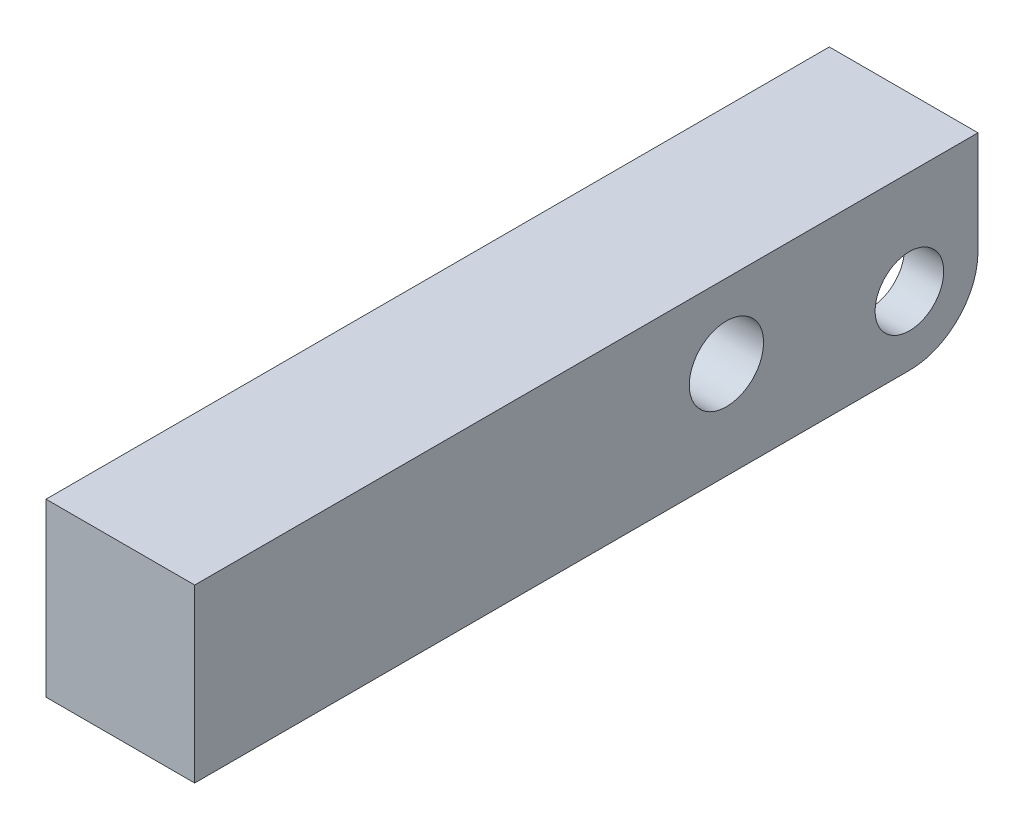
ISO-10303-21;
HEADER;
FILE_DESCRIPTION(('STEP AP214'),'2;1');
FILE_NAME('part.step','',(''),(''),'','','');
FILE_SCHEMA(('AUTOMOTIVE_DESIGN { 1 0 10303 214 1 1 1 1 }'));
ENDSEC;
DATA;
#1=APPLICATION_CONTEXT('core data for automotive mechanical design processes');
#2=APPLICATION_PROTOCOL_DEFINITION('international standard','automotive_design',2000,#1);
#3=PRODUCT_CONTEXT('',#1,'mechanical');
#4=PRODUCT('Part','Part','',(#3));
#5=PRODUCT_RELATED_PRODUCT_CATEGORY('part','',(#4));
#6=PRODUCT_DEFINITION_FORMATION('','',#4);
#7=PRODUCT_DEFINITION_CONTEXT('part definition',#1,'design');
#8=PRODUCT_DEFINITION('design','',#6,#7);
#9=PRODUCT_DEFINITION_SHAPE('','',#8);
#10=(LENGTH_UNIT() NAMED_UNIT(*) SI_UNIT(.MILLI.,.METRE.));
#11=(NAMED_UNIT(*) PLANE_ANGLE_UNIT() SI_UNIT($,.RADIAN.));
#12=(NAMED_UNIT(*) SI_UNIT($,.STERADIAN.) SOLID_ANGLE_UNIT());
#13=UNCERTAINTY_MEASURE_WITH_UNIT(LENGTH_MEASURE(1.E-05),#10,'distance_accuracy_value','');
#14=(GEOMETRIC_REPRESENTATION_CONTEXT(3) GLOBAL_UNCERTAINTY_ASSIGNED_CONTEXT((#13)) GLOBAL_UNIT_ASSIGNED_CONTEXT((#10,
#11,#12)) REPRESENTATION_CONTEXT('',''));
#15=CARTESIAN_POINT('',(0.,0.,0.));
#16=DIRECTION('',(0.,0.,1.));
#17=DIRECTION('',(1.,0.,0.));
#18=AXIS2_PLACEMENT_3D('',#15,#16,#17);
#19=CARTESIAN_POINT('',(-50.,12.,12.));
#20=DIRECTION('',(1.,0.,0.));
#21=DIRECTION('',(0.,0.,-1.));
#22=AXIS2_PLACEMENT_3D('',#19,#20,#21);
#23=CYLINDRICAL_SURFACE('',#22,6.);
#24=CARTESIAN_POINT('',(-6.1468,12.,12.));
#25=DIRECTION('',(-1.,0.,0.));
#26=DIRECTION('',(0.,0.,1.));
#27=AXIS2_PLACEMENT_3D('',#24,#25,#26);
#28=CIRCLE('',#27,6.);
#29=CARTESIAN_POINT('',(-6.1468,12.,18.));
#30=VERTEX_POINT('',#29);
#31=EDGE_CURVE('E198',#30,#30,#28,.F.);
#32=ORIENTED_EDGE('',*,*,#31,.T.);
#33=EDGE_LOOP('',(#32));
#34=FACE_BOUND('',#33,.T.);
#35=CARTESIAN_POINT('',(-13.0048,12.,12.));
#36=DIRECTION('',(-1.,0.,0.));
#37=DIRECTION('',(0.,0.,1.));
#38=AXIS2_PLACEMENT_3D('',#35,#36,#37);
#39=CIRCLE('',#38,6.);
#40=CARTESIAN_POINT('',(-13.0048,12.,18.));
#41=VERTEX_POINT('',#40);
#42=EDGE_CURVE('E161',#41,#41,#39,.T.);
#43=ORIENTED_EDGE('',*,*,#42,.T.);
#44=EDGE_LOOP('',(#43));
#45=FACE_BOUND('',#44,.T.);
#46=ADVANCED_FACE('F32',(#34,#45),#23,.F.);
#47=CARTESIAN_POINT('',(-13.0048,29.9974,0.));
#48=DIRECTION('',(0.,0.,-1.));
#49=DIRECTION('',(0.,1.,0.));
#50=AXIS2_PLACEMENT_3D('',#47,#48,#49);
#51=PLANE('',#50);
#52=DIRECTION('',(0.,1.,0.));
#53=VECTOR('',#52,1.);
#54=CARTESIAN_POINT('',(13.0048,29.9974,0.));
#55=LINE('',#54,#53);
#56=CARTESIAN_POINT('',(13.0048,11.9888,0.));
#57=VERTEX_POINT('',#56);
#58=CARTESIAN_POINT('',(13.0048,29.9974,0.));
#59=VERTEX_POINT('',#58);
#60=EDGE_CURVE('E164',#57,#59,#55,.T.);
#61=ORIENTED_EDGE('',*,*,#60,.F.);
#62=DIRECTION('',(1.,0.,0.));
#63=VECTOR('',#62,1.);
#64=CARTESIAN_POINT('',(-13.0048,11.9888,0.));
#65=LINE('',#64,#63);
#66=CARTESIAN_POINT('',(6.1468,11.9888,0.));
#67=VERTEX_POINT('',#66);
#68=EDGE_CURVE('E211',#57,#67,#65,.F.);
#69=ORIENTED_EDGE('',*,*,#68,.T.);
#70=DIRECTION('',(0.,-1.,0.));
#71=VECTOR('',#70,1.);
#72=CARTESIAN_POINT('',(6.1468,26.4,0.));
#73=LINE('',#72,#71);
#74=CARTESIAN_POINT('',(6.1468,26.4,0.));
#75=VERTEX_POINT('',#74);
#76=EDGE_CURVE('E131',#75,#67,#73,.T.);
#77=ORIENTED_EDGE('',*,*,#76,.F.);
#78=DIRECTION('',(1.,0.,0.));
#79=VECTOR('',#78,1.);
#80=CARTESIAN_POINT('',(-6.1468,26.4,0.));
#81=LINE('',#80,#79);
#82=CARTESIAN_POINT('',(-6.1468,26.4,0.));
#83=VERTEX_POINT('',#82);
#84=EDGE_CURVE('E138',#83,#75,#81,.T.);
#85=ORIENTED_EDGE('',*,*,#84,.F.);
#86=DIRECTION('',(0.,-1.,0.));
#87=VECTOR('',#86,1.);
#88=CARTESIAN_POINT('',(-6.1468,26.4,0.));
#89=LINE('',#88,#87);
#90=CARTESIAN_POINT('',(-6.1468,11.9888,0.));
#91=VERTEX_POINT('',#90);
#92=EDGE_CURVE('E121',#83,#91,#89,.T.);
#93=ORIENTED_EDGE('',*,*,#92,.T.);
#94=DIRECTION('',(1.,0.,0.));
#95=VECTOR('',#94,1.);
#96=CARTESIAN_POINT('',(-13.0048,11.9888,0.));
#97=LINE('',#96,#95);
#98=CARTESIAN_POINT('',(-13.0048,11.9888,0.));
#99=VERTEX_POINT('',#98);
#100=EDGE_CURVE('E209',#91,#99,#97,.F.);
#101=ORIENTED_EDGE('',*,*,#100,.T.);
#102=DIRECTION('',(0.,1.,0.));
#103=VECTOR('',#102,1.);
#104=CARTESIAN_POINT('',(-13.0048,29.9974,0.));
#105=LINE('',#104,#103);
#106=CARTESIAN_POINT('',(-13.0048,29.9974,0.));
#107=VERTEX_POINT('',#106);
#108=EDGE_CURVE('E175',#99,#107,#105,.T.);
#109=ORIENTED_EDGE('',*,*,#108,.T.);
#110=DIRECTION('',(1.,0.,0.));
#111=VECTOR('',#110,1.);
#112=CARTESIAN_POINT('',(-13.0048,29.9974,0.));
#113=LINE('',#112,#111);
#114=EDGE_CURVE('E186',#107,#59,#113,.T.);
#115=ORIENTED_EDGE('',*,*,#114,.T.);
#116=EDGE_LOOP('',(#61,#69,#77,#85,#93,#101,#109,#115));
#117=FACE_BOUND('',#116,.T.);
#118=ADVANCED_FACE('F143',(#117),#51,.T.);
#119=CARTESIAN_POINT('',(-13.0048,0.,0.));
#120=DIRECTION('',(0.,-1.,0.));
#121=DIRECTION('',(0.,0.,-1.));
#122=AXIS2_PLACEMENT_3D('',#119,#120,#121);
#123=PLANE('',#122);
#124=CARTESIAN_POINT('',(0.,0.,26.3906));
#125=DIRECTION('',(0.,-1.,0.));
#126=DIRECTION('',(0.,0.,-1.));
#127=AXIS2_PLACEMENT_3D('',#124,#125,#126);
#128=CIRCLE('',#127,6.90880000000001);
#129=CARTESIAN_POINT('',(-6.90880000000001,0.,26.3906));
#130=VERTEX_POINT('',#129);
#131=CARTESIAN_POINT('',(6.90880000000001,0.,26.3906));
#132=VERTEX_POINT('',#131);
#133=EDGE_CURVE('E224',#130,#132,#128,.F.);
#134=ORIENTED_EDGE('',*,*,#133,.T.);
#135=DIRECTION('',(0.,0.,-1.));
#136=VECTOR('',#135,1.);
#137=CARTESIAN_POINT('',(6.90880000000001,0.,11.9888));
#138=LINE('',#137,#136);
#139=CARTESIAN_POINT('',(6.90880000000001,0.,11.9888));
#140=VERTEX_POINT('',#139);
#141=EDGE_CURVE('E226',#132,#140,#138,.T.);
#142=ORIENTED_EDGE('',*,*,#141,.T.);
#143=DIRECTION('',(1.,0.,0.));
#144=VECTOR('',#143,1.);
#145=CARTESIAN_POINT('',(-13.0048,0.,11.9888));
#146=LINE('',#145,#144);
#147=CARTESIAN_POINT('',(13.0048,0.,11.9888));
#148=VERTEX_POINT('',#147);
#149=EDGE_CURVE('E205',#140,#148,#146,.T.);
#150=ORIENTED_EDGE('',*,*,#149,.T.);
#151=DIRECTION('',(0.,0.,-1.));
#152=VECTOR('',#151,1.);
#153=CARTESIAN_POINT('',(13.0048,0.,0.));
#154=LINE('',#153,#152);
#155=CARTESIAN_POINT('',(13.0048,0.,137.0076));
#156=VERTEX_POINT('',#155);
#157=EDGE_CURVE('E172',#156,#148,#154,.T.);
#158=ORIENTED_EDGE('',*,*,#157,.F.);
#159=DIRECTION('',(1.,0.,0.));
#160=VECTOR('',#159,1.);
#161=CARTESIAN_POINT('',(-13.0048,0.,137.0076));
#162=LINE('',#161,#160);
#163=CARTESIAN_POINT('',(-13.0048,0.,137.0076));
#164=VERTEX_POINT('',#163);
#165=EDGE_CURVE('E187',#164,#156,#162,.T.);
#166=ORIENTED_EDGE('',*,*,#165,.F.);
#167=DIRECTION('',(0.,0.,-1.));
#168=VECTOR('',#167,1.);
#169=CARTESIAN_POINT('',(-13.0048,0.,0.));
#170=LINE('',#169,#168);
#171=CARTESIAN_POINT('',(-13.0048,0.,11.9888));
#172=VERTEX_POINT('',#171);
#173=EDGE_CURVE('E183',#164,#172,#170,.T.);
#174=ORIENTED_EDGE('',*,*,#173,.T.);
#175=DIRECTION('',(1.,0.,0.));
#176=VECTOR('',#175,1.);
#177=CARTESIAN_POINT('',(-13.0048,0.,11.9888));
#178=LINE('',#177,#176);
#179=CARTESIAN_POINT('',(-6.90880000000001,0.,11.9888));
#180=VERTEX_POINT('',#179);
#181=EDGE_CURVE('E189',#172,#180,#178,.T.);
#182=ORIENTED_EDGE('',*,*,#181,.T.);
#183=DIRECTION('',(0.,0.,1.));
#184=VECTOR('',#183,1.);
#185=CARTESIAN_POINT('',(-6.90880000000001,0.,26.3906));
#186=LINE('',#185,#184);
#187=EDGE_CURVE('E222',#180,#130,#186,.T.);
#188=ORIENTED_EDGE('',*,*,#187,.T.);
#189=EDGE_LOOP('',(#134,#142,#150,#158,#166,#174,#182,#188));
#190=FACE_BOUND('',#189,.T.);
#191=ADVANCED_FACE('F249',(#190),#123,.T.);
#192=CARTESIAN_POINT('',(-13.0048,0.,137.0076));
#193=DIRECTION('',(0.,0.,1.));
#194=DIRECTION('',(1.,0.,0.));
#195=AXIS2_PLACEMENT_3D('',#192,#193,#194);
#196=PLANE('',#195);
#197=ORIENTED_EDGE('',*,*,#165,.T.);
#198=DIRECTION('',(0.,-1.,0.));
#199=VECTOR('',#198,1.);
#200=CARTESIAN_POINT('',(13.0048,0.,137.0076));
#201=LINE('',#200,#199);
#202=CARTESIAN_POINT('',(13.0048,29.9974,137.0076));
#203=VERTEX_POINT('',#202);
#204=EDGE_CURVE('E169',#203,#156,#201,.T.);
#205=ORIENTED_EDGE('',*,*,#204,.F.);
#206=DIRECTION('',(1.,0.,0.));
#207=VECTOR('',#206,1.);
#208=CARTESIAN_POINT('',(-13.0048,29.9974,137.0076));
#209=LINE('',#208,#207);
#210=CARTESIAN_POINT('',(-13.0048,29.9974,137.0076));
#211=VERTEX_POINT('',#210);
#212=EDGE_CURVE('E190',#211,#203,#209,.T.);
#213=ORIENTED_EDGE('',*,*,#212,.F.);
#214=DIRECTION('',(0.,-1.,0.));
#215=VECTOR('',#214,1.);
#216=CARTESIAN_POINT('',(-13.0048,0.,137.0076));
#217=LINE('',#216,#215);
#218=EDGE_CURVE('E180',#211,#164,#217,.T.);
#219=ORIENTED_EDGE('',*,*,#218,.T.);
#220=EDGE_LOOP('',(#197,#205,#213,#219));
#221=FACE_BOUND('',#220,.T.);
#222=ADVANCED_FACE('F265',(#221),#196,.T.);
#223=CARTESIAN_POINT('',(-13.0048,29.9974,137.0076));
#224=DIRECTION('',(0.,1.,0.));
#225=DIRECTION('',(0.,0.,1.));
#226=AXIS2_PLACEMENT_3D('',#223,#224,#225);
#227=PLANE('',#226);
#228=ORIENTED_EDGE('',*,*,#212,.T.);
#229=DIRECTION('',(0.,0.,1.));
#230=VECTOR('',#229,1.);
#231=CARTESIAN_POINT('',(13.0048,29.9974,137.0076));
#232=LINE('',#231,#230);
#233=EDGE_CURVE('E166',#59,#203,#232,.T.);
#234=ORIENTED_EDGE('',*,*,#233,.F.);
#235=ORIENTED_EDGE('',*,*,#114,.F.);
#236=DIRECTION('',(0.,0.,1.));
#237=VECTOR('',#236,1.);
#238=CARTESIAN_POINT('',(-13.0048,29.9974,137.0076));
#239=LINE('',#238,#237);
#240=EDGE_CURVE('E177',#107,#211,#239,.T.);
#241=ORIENTED_EDGE('',*,*,#240,.T.);
#242=EDGE_LOOP('',(#228,#234,#235,#241));
#243=FACE_BOUND('',#242,.T.);
#244=ADVANCED_FACE('F260',(#243),#227,.T.);
#245=CARTESIAN_POINT('',(-13.0048,0.,0.));
#246=DIRECTION('',(-1.,0.,0.));
#247=DIRECTION('',(0.,0.,1.));
#248=AXIS2_PLACEMENT_3D('',#245,#246,#247);
#249=PLANE('',#248);
#250=CARTESIAN_POINT('',(-13.0048,17.0038,44.004));
#251=DIRECTION('',(-1.,0.,0.));
#252=DIRECTION('',(0.,0.,1.));
#253=AXIS2_PLACEMENT_3D('',#250,#251,#252);
#254=CIRCLE('',#253,6.5);
#255=CARTESIAN_POINT('',(-13.0048,17.0038,50.504));
#256=VERTEX_POINT('',#255);
#257=EDGE_CURVE('E156',#256,#256,#254,.T.);
#258=ORIENTED_EDGE('',*,*,#257,.F.);
#259=EDGE_LOOP('',(#258));
#260=FACE_BOUND('',#259,.T.);
#261=ORIENTED_EDGE('',*,*,#42,.F.);
#262=EDGE_LOOP('',(#261));
#263=FACE_BOUND('',#262,.T.);
#264=ORIENTED_EDGE('',*,*,#108,.F.);
#265=CARTESIAN_POINT('',(-13.0048,11.9888,11.9888));
#266=DIRECTION('',(-1.,0.,0.));
#267=DIRECTION('',(0.,0.,1.));
#268=AXIS2_PLACEMENT_3D('',#265,#266,#267);
#269=CIRCLE('',#268,11.9888);
#270=EDGE_CURVE('E217',#99,#172,#269,.T.);
#271=ORIENTED_EDGE('',*,*,#270,.T.);
#272=ORIENTED_EDGE('',*,*,#173,.F.);
#273=ORIENTED_EDGE('',*,*,#218,.F.);
#274=ORIENTED_EDGE('',*,*,#240,.F.);
#275=EDGE_LOOP('',(#264,#271,#272,#273,#274));
#276=FACE_BOUND('',#275,.T.);
#277=ADVANCED_FACE('F255',(#260,#263,#276),#249,.T.);
#278=CARTESIAN_POINT('',(13.0048,0.,0.));
#279=DIRECTION('',(-1.,0.,0.));
#280=DIRECTION('',(0.,0.,1.));
#281=AXIS2_PLACEMENT_3D('',#278,#279,#280);
#282=PLANE('',#281);
#283=CARTESIAN_POINT('',(13.0048,17.0038,44.004));
#284=DIRECTION('',(-1.,0.,0.));
#285=DIRECTION('',(0.,0.,1.));
#286=AXIS2_PLACEMENT_3D('',#283,#284,#285);
#287=CIRCLE('',#286,6.5);
#288=CARTESIAN_POINT('',(13.0048,17.0038,50.504));
#289=VERTEX_POINT('',#288);
#290=EDGE_CURVE('E160',#289,#289,#287,.T.);
#291=ORIENTED_EDGE('',*,*,#290,.T.);
#292=EDGE_LOOP('',(#291));
#293=FACE_BOUND('',#292,.T.);
#294=CARTESIAN_POINT('',(13.0048,12.,12.));
#295=DIRECTION('',(-1.,0.,0.));
#296=DIRECTION('',(0.,0.,1.));
#297=AXIS2_PLACEMENT_3D('',#294,#295,#296);
#298=CIRCLE('',#297,6.);
#299=CARTESIAN_POINT('',(13.0048,12.,18.));
#300=VERTEX_POINT('',#299);
#301=EDGE_CURVE('E159',#300,#300,#298,.T.);
#302=ORIENTED_EDGE('',*,*,#301,.T.);
#303=EDGE_LOOP('',(#302));
#304=FACE_BOUND('',#303,.T.);
#305=ORIENTED_EDGE('',*,*,#157,.T.);
#306=CARTESIAN_POINT('',(13.0048,11.9888,11.9888));
#307=DIRECTION('',(-1.,0.,0.));
#308=DIRECTION('',(0.,0.,1.));
#309=AXIS2_PLACEMENT_3D('',#306,#307,#308);
#310=CIRCLE('',#309,11.9888);
#311=EDGE_CURVE('E207',#148,#57,#310,.F.);
#312=ORIENTED_EDGE('',*,*,#311,.T.);
#313=ORIENTED_EDGE('',*,*,#60,.T.);
#314=ORIENTED_EDGE('',*,*,#233,.T.);
#315=ORIENTED_EDGE('',*,*,#204,.T.);
#316=EDGE_LOOP('',(#305,#312,#313,#314,#315));
#317=FACE_BOUND('',#316,.T.);
#318=ADVANCED_FACE('F263',(#293,#304,#317),#282,.F.);
#319=CARTESIAN_POINT('',(6.1468,12.,12.));
#320=DIRECTION('',(1.,0.,0.));
#321=DIRECTION('',(0.,0.,-1.));
#322=AXIS2_PLACEMENT_3D('',#319,#320,#321);
#323=CIRCLE('',#322,6.);
#324=CARTESIAN_POINT('',(6.1468,12.,6.));
#325=VERTEX_POINT('',#324);
#326=EDGE_CURVE('E152',#325,#325,#323,.F.);
#327=ORIENTED_EDGE('',*,*,#326,.T.);
#328=EDGE_LOOP('',(#327));
#329=FACE_BOUND('',#328,.T.);
#330=ORIENTED_EDGE('',*,*,#301,.F.);
#331=EDGE_LOOP('',(#330));
#332=FACE_BOUND('',#331,.T.);
#333=ADVANCED_FACE('F277',(#329,#332),#23,.F.);
#334=CARTESIAN_POINT('',(-50.,17.0038,44.004));
#335=DIRECTION('',(1.,0.,0.));
#336=DIRECTION('',(0.,0.,-1.));
#337=AXIS2_PLACEMENT_3D('',#334,#335,#336);
#338=CYLINDRICAL_SURFACE('',#337,6.5);
#339=ORIENTED_EDGE('',*,*,#257,.T.);
#340=EDGE_LOOP('',(#339));
#341=FACE_BOUND('',#340,.T.);
#342=ORIENTED_EDGE('',*,*,#290,.F.);
#343=EDGE_LOOP('',(#342));
#344=FACE_BOUND('',#343,.T.);
#345=ADVANCED_FACE('F286',(#341,#344),#338,.F.);
#346=CARTESIAN_POINT('',(-6.1468,26.4,26.3906));
#347=DIRECTION('',(-1.,0.,0.));
#348=DIRECTION('',(0.,0.,1.));
#349=AXIS2_PLACEMENT_3D('',#346,#347,#348);
#350=PLANE('',#349);
#351=DIRECTION('',(0.,-1.,0.));
#352=VECTOR('',#351,1.);
#353=CARTESIAN_POINT('',(-6.1468,26.4,26.3906));
#354=LINE('',#353,#352);
#355=CARTESIAN_POINT('',(-6.1468,26.4,26.3906));
#356=VERTEX_POINT('',#355);
#357=CARTESIAN_POINT('',(-6.1468,0.762000000000009,26.3906));
#358=VERTEX_POINT('',#357);
#359=EDGE_CURVE('E150',#356,#358,#354,.T.);
#360=ORIENTED_EDGE('',*,*,#359,.T.);
#361=DIRECTION('',(0.,0.,-1.));
#362=VECTOR('',#361,1.);
#363=CARTESIAN_POINT('',(-6.1468,0.762000000000011,11.9888));
#364=LINE('',#363,#362);
#365=CARTESIAN_POINT('',(-6.1468,0.762000000000013,7.78281768905285));
#366=VERTEX_POINT('',#365);
#367=EDGE_CURVE('E41',#358,#366,#364,.T.);
#368=ORIENTED_EDGE('',*,*,#367,.T.);
#369=CARTESIAN_POINT('',(-6.1468,11.9888,11.9888));
#370=DIRECTION('',(-1.,0.,0.));
#371=DIRECTION('',(0.,0.,1.));
#372=AXIS2_PLACEMENT_3D('',#369,#370,#371);
#373=CIRCLE('',#372,11.9888);
#374=EDGE_CURVE('E127',#366,#91,#373,.F.);
#375=ORIENTED_EDGE('',*,*,#374,.T.);
#376=ORIENTED_EDGE('',*,*,#92,.F.);
#377=DIRECTION('',(0.,0.,-1.));
#378=VECTOR('',#377,1.);
#379=CARTESIAN_POINT('',(-6.1468,26.4,26.3906));
#380=LINE('',#379,#378);
#381=EDGE_CURVE('E125',#356,#83,#380,.T.);
#382=ORIENTED_EDGE('',*,*,#381,.F.);
#383=EDGE_LOOP('',(#360,#368,#375,#376,#382));
#384=FACE_BOUND('',#383,.T.);
#385=ORIENTED_EDGE('',*,*,#31,.F.);
#386=EDGE_LOOP('',(#385));
#387=FACE_BOUND('',#386,.T.);
#388=ADVANCED_FACE('F123',(#384,#387),#350,.F.);
#389=CARTESIAN_POINT('',(6.1468,26.4,26.3906));
#390=DIRECTION('',(1.,0.,0.));
#391=DIRECTION('',(0.,0.,-1.));
#392=AXIS2_PLACEMENT_3D('',#389,#390,#391);
#393=PLANE('',#392);
#394=CARTESIAN_POINT('',(6.1468,11.9888,11.9888));
#395=DIRECTION('',(1.,0.,0.));
#396=DIRECTION('',(0.,0.,-1.));
#397=AXIS2_PLACEMENT_3D('',#394,#395,#396);
#398=CIRCLE('',#397,11.9888);
#399=CARTESIAN_POINT('',(6.1468,0.76200000000001,7.78281768905286));
#400=VERTEX_POINT('',#399);
#401=EDGE_CURVE('E213',#67,#400,#398,.F.);
#402=ORIENTED_EDGE('',*,*,#401,.T.);
#403=DIRECTION('',(0.,0.,1.));
#404=VECTOR('',#403,1.);
#405=CARTESIAN_POINT('',(6.1468,0.762000000000009,26.3906));
#406=LINE('',#405,#404);
#407=CARTESIAN_POINT('',(6.1468,0.762000000000009,26.3906));
#408=VERTEX_POINT('',#407);
#409=EDGE_CURVE('E219',#400,#408,#406,.T.);
#410=ORIENTED_EDGE('',*,*,#409,.T.);
#411=DIRECTION('',(0.,-1.,0.));
#412=VECTOR('',#411,1.);
#413=CARTESIAN_POINT('',(6.1468,26.4,26.3906));
#414=LINE('',#413,#412);
#415=CARTESIAN_POINT('',(6.1468,26.4,26.3906));
#416=VERTEX_POINT('',#415);
#417=EDGE_CURVE('E153',#416,#408,#414,.T.);
#418=ORIENTED_EDGE('',*,*,#417,.F.);
#419=DIRECTION('',(0.,0.,1.));
#420=VECTOR('',#419,1.);
#421=CARTESIAN_POINT('',(6.1468,26.4,26.3906));
#422=LINE('',#421,#420);
#423=EDGE_CURVE('E145',#75,#416,#422,.T.);
#424=ORIENTED_EDGE('',*,*,#423,.F.);
#425=ORIENTED_EDGE('',*,*,#76,.T.);
#426=EDGE_LOOP('',(#402,#410,#418,#424,#425));
#427=FACE_BOUND('',#426,.T.);
#428=ORIENTED_EDGE('',*,*,#326,.F.);
#429=EDGE_LOOP('',(#428));
#430=FACE_BOUND('',#429,.T.);
#431=ADVANCED_FACE('F299',(#427,#430),#393,.F.);
#432=CARTESIAN_POINT('',(0.,26.4,26.3906));
#433=DIRECTION('',(0.,-1.,0.));
#434=DIRECTION('',(0.,0.,-1.));
#435=AXIS2_PLACEMENT_3D('',#432,#433,#434);
#436=CYLINDRICAL_SURFACE('',#435,6.1468);
#437=ORIENTED_EDGE('',*,*,#417,.T.);
#438=CARTESIAN_POINT('',(0.,0.762000000000009,26.3906));
#439=DIRECTION('',(0.,-1.,0.));
#440=DIRECTION('',(0.,0.,-1.));
#441=AXIS2_PLACEMENT_3D('',#438,#439,#440);
#442=CIRCLE('',#441,6.1468);
#443=EDGE_CURVE('E56',#408,#358,#442,.T.);
#444=ORIENTED_EDGE('',*,*,#443,.T.);
#445=ORIENTED_EDGE('',*,*,#359,.F.);
#446=CARTESIAN_POINT('',(0.,26.4,26.3906));
#447=DIRECTION('',(0.,-1.,0.));
#448=DIRECTION('',(0.,0.,-1.));
#449=AXIS2_PLACEMENT_3D('',#446,#447,#448);
#450=CIRCLE('',#449,6.1468);
#451=EDGE_CURVE('E132',#416,#356,#450,.T.);
#452=ORIENTED_EDGE('',*,*,#451,.F.);
#453=EDGE_LOOP('',(#437,#444,#445,#452));
#454=FACE_BOUND('',#453,.T.);
#455=ADVANCED_FACE('F301',(#454),#436,.F.);
#456=CARTESIAN_POINT('',(0.,26.4,26.3906));
#457=DIRECTION('',(0.,-1.,0.));
#458=DIRECTION('',(0.,0.,-1.));
#459=AXIS2_PLACEMENT_3D('',#456,#457,#458);
#460=PLANE('',#459);
#461=ORIENTED_EDGE('',*,*,#381,.T.);
#462=ORIENTED_EDGE('',*,*,#84,.T.);
#463=ORIENTED_EDGE('',*,*,#423,.T.);
#464=ORIENTED_EDGE('',*,*,#451,.T.);
#465=EDGE_LOOP('',(#461,#462,#463,#464));
#466=FACE_BOUND('',#465,.T.);
#467=ADVANCED_FACE('F136',(#466),#460,.T.);
#468=CARTESIAN_POINT('',(-13.0048,11.9888,11.9888));
#469=DIRECTION('',(1.,0.,0.));
#470=DIRECTION('',(0.,0.,-1.));
#471=AXIS2_PLACEMENT_3D('',#468,#469,#470);
#472=CYLINDRICAL_SURFACE('',#471,11.9888);
#473=ORIENTED_EDGE('',*,*,#149,.F.);
#474=CARTESIAN_POINT('',(-5.07999999999995,11.9888,11.9888));
#475=DIRECTION('',(-0.707106781186549,-0.707106781186546,0.));
#476=DIRECTION('',(0.707106781186546,-0.707106781186549,0.));
#477=AXIS2_PLACEMENT_3D('',#474,#475,#476);
#478=ELLIPSE('',#477,16.9547235565785,11.9888);
#479=EDGE_CURVE('E228',#140,#400,#478,.F.);
#480=ORIENTED_EDGE('',*,*,#479,.T.);
#481=ORIENTED_EDGE('',*,*,#401,.F.);
#482=ORIENTED_EDGE('',*,*,#68,.F.);
#483=ORIENTED_EDGE('',*,*,#311,.F.);
#484=EDGE_LOOP('',(#473,#480,#481,#482,#483));
#485=FACE_BOUND('',#484,.T.);
#486=ADVANCED_FACE('F312',(#485),#472,.T.);
#487=CARTESIAN_POINT('',(-13.0048,11.9888,11.9888));
#488=DIRECTION('',(1.,0.,0.));
#489=DIRECTION('',(0.,0.,-1.));
#490=AXIS2_PLACEMENT_3D('',#487,#488,#489);
#491=CYLINDRICAL_SURFACE('',#490,11.9888);
#492=ORIENTED_EDGE('',*,*,#374,.F.);
#493=CARTESIAN_POINT('',(5.07999999999999,11.9888,11.9888));
#494=DIRECTION('',(0.707106781186547,-0.707106781186548,0.));
#495=DIRECTION('',(0.707106781186548,0.707106781186547,0.));
#496=AXIS2_PLACEMENT_3D('',#493,#494,#495);
#497=ELLIPSE('',#496,16.9547235565786,11.9888);
#498=EDGE_CURVE('E11',#366,#180,#497,.F.);
#499=ORIENTED_EDGE('',*,*,#498,.T.);
#500=ORIENTED_EDGE('',*,*,#181,.F.);
#501=ORIENTED_EDGE('',*,*,#270,.F.);
#502=ORIENTED_EDGE('',*,*,#100,.F.);
#503=EDGE_LOOP('',(#492,#499,#500,#501,#502));
#504=FACE_BOUND('',#503,.T.);
#505=ADVANCED_FACE('F246',(#504),#491,.T.);
#506=CARTESIAN_POINT('',(-6.1468,0.762000000000009,26.3906));
#507=DIRECTION('',(0.707106781186547,-0.707106781186548,0.));
#508=DIRECTION('',(0.707106781186548,0.707106781186547,0.));
#509=AXIS2_PLACEMENT_3D('',#506,#507,#508);
#510=PLANE('',#509);
#511=ORIENTED_EDGE('',*,*,#498,.F.);
#512=ORIENTED_EDGE('',*,*,#367,.F.);
#513=DIRECTION('',(0.707106781186548,0.707106781186547,0.));
#514=VECTOR('',#513,1.);
#515=CARTESIAN_POINT('',(-6.90880000000001,0.,26.3906));
#516=LINE('',#515,#514);
#517=EDGE_CURVE('E36',#130,#358,#516,.T.);
#518=ORIENTED_EDGE('',*,*,#517,.F.);
#519=ORIENTED_EDGE('',*,*,#187,.F.);
#520=EDGE_LOOP('',(#511,#512,#518,#519));
#521=FACE_BOUND('',#520,.T.);
#522=ADVANCED_FACE('F34',(#521),#510,.T.);
#523=CARTESIAN_POINT('',(0.,0.762000000000009,26.3906));
#524=DIRECTION('',(0.,-1.,0.));
#525=DIRECTION('',(0.,0.,-1.));
#526=AXIS2_PLACEMENT_3D('',#523,#524,#525);
#527=CONICAL_SURFACE('',#526,6.1468,0.785398163397448);
#528=ORIENTED_EDGE('',*,*,#517,.T.);
#529=ORIENTED_EDGE('',*,*,#443,.F.);
#530=DIRECTION('',(-0.707106781186548,0.707106781186547,0.));
#531=VECTOR('',#530,1.);
#532=CARTESIAN_POINT('',(6.90880000000001,0.,26.3906));
#533=LINE('',#532,#531);
#534=EDGE_CURVE('E231',#132,#408,#533,.T.);
#535=ORIENTED_EDGE('',*,*,#534,.F.);
#536=ORIENTED_EDGE('',*,*,#133,.F.);
#537=EDGE_LOOP('',(#528,#529,#535,#536));
#538=FACE_BOUND('',#537,.T.);
#539=ADVANCED_FACE('F240',(#538),#527,.F.);
#540=CARTESIAN_POINT('',(6.1468,0.762000000000009,26.3906));
#541=DIRECTION('',(-0.707106781186549,-0.707106781186546,0.));
#542=DIRECTION('',(0.707106781186546,-0.707106781186549,0.));
#543=AXIS2_PLACEMENT_3D('',#540,#541,#542);
#544=PLANE('',#543);
#545=ORIENTED_EDGE('',*,*,#479,.F.);
#546=ORIENTED_EDGE('',*,*,#141,.F.);
#547=ORIENTED_EDGE('',*,*,#534,.T.);
#548=ORIENTED_EDGE('',*,*,#409,.F.);
#549=EDGE_LOOP('',(#545,#546,#547,#548));
#550=FACE_BOUND('',#549,.T.);
#551=ADVANCED_FACE('F324',(#550),#544,.T.);
#552=CLOSED_SHELL('',(#46,#118,#191,#222,#244,#277,#318,#333,#345,#388,#431,#455,#467,#486,#505,
#522,#539,#551));
#553=MANIFOLD_SOLID_BREP('B2',#552);
#554=ADVANCED_BREP_SHAPE_REPRESENTATION('',(#18,#553),#14);
#555=SHAPE_DEFINITION_REPRESENTATION(#9,#554);
ENDSEC;
END-ISO-10303-21;
